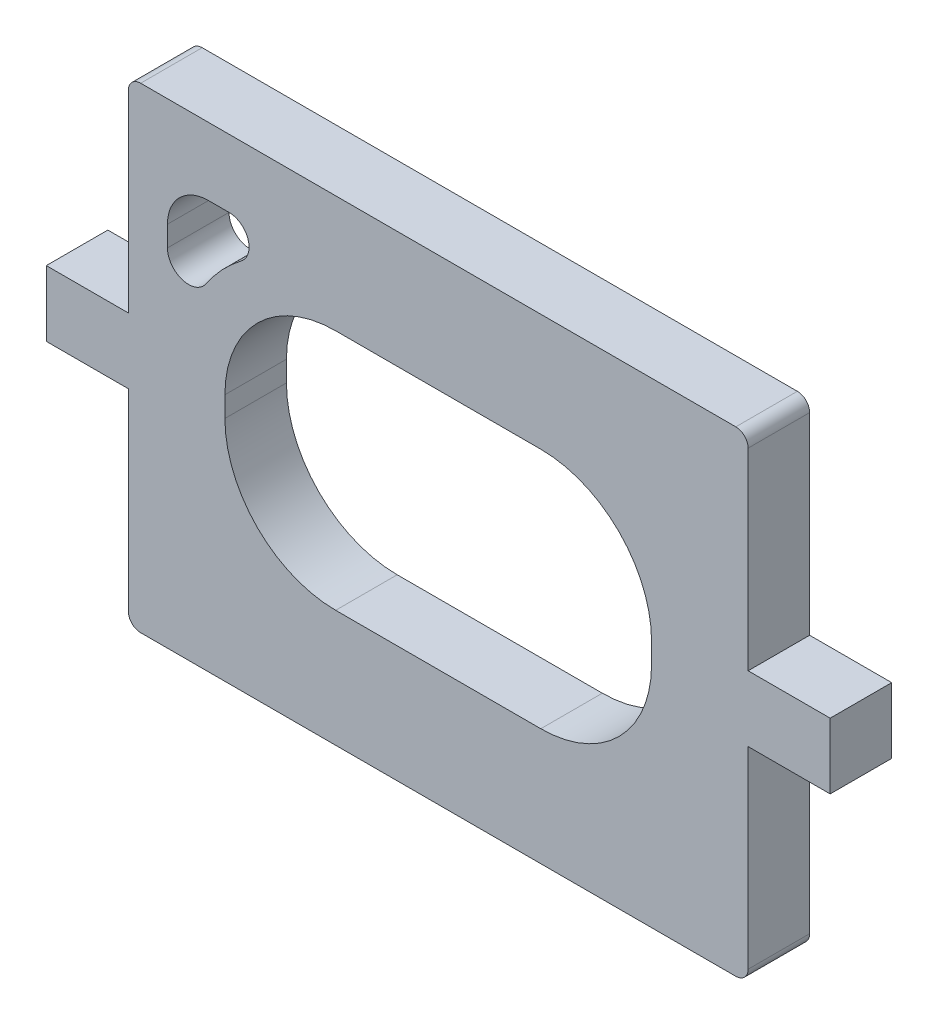
ISO-10303-21;
HEADER;
FILE_DESCRIPTION(('STEP AP214'),'2;1');
FILE_NAME('part.step','',(''),(''),'','','');
FILE_SCHEMA(('AUTOMOTIVE_DESIGN { 1 0 10303 214 1 1 1 1 }'));
ENDSEC;
DATA;
#1=APPLICATION_CONTEXT('core data for automotive mechanical design processes');
#2=APPLICATION_PROTOCOL_DEFINITION('international standard','automotive_design',2000,#1);
#3=PRODUCT_CONTEXT('',#1,'mechanical');
#4=PRODUCT('Part','Part','',(#3));
#5=PRODUCT_RELATED_PRODUCT_CATEGORY('part','',(#4));
#6=PRODUCT_DEFINITION_FORMATION('','',#4);
#7=PRODUCT_DEFINITION_CONTEXT('part definition',#1,'design');
#8=PRODUCT_DEFINITION('design','',#6,#7);
#9=PRODUCT_DEFINITION_SHAPE('','',#8);
#10=(LENGTH_UNIT() NAMED_UNIT(*) SI_UNIT(.MILLI.,.METRE.));
#11=(NAMED_UNIT(*) PLANE_ANGLE_UNIT() SI_UNIT($,.RADIAN.));
#12=(NAMED_UNIT(*) SI_UNIT($,.STERADIAN.) SOLID_ANGLE_UNIT());
#13=UNCERTAINTY_MEASURE_WITH_UNIT(LENGTH_MEASURE(1.E-05),#10,'distance_accuracy_value','');
#14=(GEOMETRIC_REPRESENTATION_CONTEXT(3) GLOBAL_UNCERTAINTY_ASSIGNED_CONTEXT((#13)) GLOBAL_UNIT_ASSIGNED_CONTEXT((#10,
#11,#12)) REPRESENTATION_CONTEXT('',''));
#15=CARTESIAN_POINT('',(0.,0.,0.));
#16=DIRECTION('',(0.,0.,1.));
#17=DIRECTION('',(1.,0.,0.));
#18=AXIS2_PLACEMENT_3D('',#15,#16,#17);
#19=CARTESIAN_POINT('',(34.5642124224768,0.0502130412616117,1.5));
#20=DIRECTION('',(-1.,0.,0.));
#21=DIRECTION('',(0.,0.,1.));
#22=AXIS2_PLACEMENT_3D('',#19,#20,#21);
#23=PLANE('',#22);
#24=DIRECTION('',(0.,0.,-1.));
#25=VECTOR('',#24,1.);
#26=CARTESIAN_POINT('',(34.5642124224768,-6.54978695873839,1.5));
#27=LINE('',#26,#25);
#28=CARTESIAN_POINT('',(34.5642124224768,-6.54978695873839,1.5));
#29=VERTEX_POINT('',#28);
#30=CARTESIAN_POINT('',(34.5642124224768,-6.54978695873839,0.));
#31=VERTEX_POINT('',#30);
#32=EDGE_CURVE('E265',#29,#31,#27,.T.);
#33=ORIENTED_EDGE('',*,*,#32,.F.);
#34=DIRECTION('',(0.,1.,0.));
#35=VECTOR('',#34,1.);
#36=CARTESIAN_POINT('',(34.5642124224768,0.0502130412616117,1.5));
#37=LINE('',#36,#35);
#38=CARTESIAN_POINT('',(34.5642124224768,-11.2497869587384,1.5));
#39=VERTEX_POINT('',#38);
#40=EDGE_CURVE('E412',#39,#29,#37,.T.);
#41=ORIENTED_EDGE('',*,*,#40,.F.);
#42=DIRECTION('',(0.,0.,-1.));
#43=VECTOR('',#42,1.);
#44=CARTESIAN_POINT('',(34.5642124224768,-11.2497869587384,1.5));
#45=LINE('',#44,#43);
#46=CARTESIAN_POINT('',(34.5642124224768,-11.2497869587384,0.));
#47=VERTEX_POINT('',#46);
#48=EDGE_CURVE('E444',#39,#47,#45,.T.);
#49=ORIENTED_EDGE('',*,*,#48,.T.);
#50=DIRECTION('',(0.,1.,0.));
#51=VECTOR('',#50,1.);
#52=CARTESIAN_POINT('',(34.5642124224768,0.0502130412616117,0.));
#53=LINE('',#52,#51);
#54=EDGE_CURVE('E425',#47,#31,#53,.T.);
#55=ORIENTED_EDGE('',*,*,#54,.T.);
#56=EDGE_LOOP('',(#33,#41,#49,#55));
#57=FACE_BOUND('',#56,.T.);
#58=ADVANCED_FACE('F44',(#57),#23,.F.);
#59=DIRECTION('',(0.,0.,1.));
#60=VECTOR('',#59,1.);
#61=CARTESIAN_POINT('',(34.5642124224768,-4.94978695873839,0.));
#62=LINE('',#61,#60);
#63=CARTESIAN_POINT('',(34.5642124224768,-4.94978695873839,0.));
#64=VERTEX_POINT('',#63);
#65=CARTESIAN_POINT('',(34.5642124224768,-4.94978695873839,1.5));
#66=VERTEX_POINT('',#65);
#67=EDGE_CURVE('E261',#64,#66,#62,.T.);
#68=ORIENTED_EDGE('',*,*,#67,.F.);
#69=CARTESIAN_POINT('',(34.5642124224768,-0.249786958738388,0.));
#70=VERTEX_POINT('',#69);
#71=EDGE_CURVE('E424',#64,#70,#53,.T.);
#72=ORIENTED_EDGE('',*,*,#71,.T.);
#73=DIRECTION('',(0.,0.,-1.));
#74=VECTOR('',#73,1.);
#75=CARTESIAN_POINT('',(34.5642124224768,-0.249786958738388,1.5));
#76=LINE('',#75,#74);
#77=CARTESIAN_POINT('',(34.5642124224768,-0.249786958738388,1.5));
#78=VERTEX_POINT('',#77);
#79=EDGE_CURVE('E447',#70,#78,#76,.F.);
#80=ORIENTED_EDGE('',*,*,#79,.T.);
#81=EDGE_CURVE('E411',#66,#78,#37,.T.);
#82=ORIENTED_EDGE('',*,*,#81,.F.);
#83=EDGE_LOOP('',(#68,#72,#80,#82));
#84=FACE_BOUND('',#83,.T.);
#85=ADVANCED_FACE('F515',(#84),#23,.F.);
#86=CARTESIAN_POINT('',(19.4567043731273,-11.5497869587384,1.5));
#87=DIRECTION('',(1.,0.,0.));
#88=DIRECTION('',(0.,0.,-1.));
#89=AXIS2_PLACEMENT_3D('',#86,#87,#88);
#90=PLANE('',#89);
#91=DIRECTION('',(0.,0.,-1.));
#92=VECTOR('',#91,1.);
#93=CARTESIAN_POINT('',(19.4567043731273,-4.94978695873839,1.5));
#94=LINE('',#93,#92);
#95=CARTESIAN_POINT('',(19.4567043731273,-4.94978695873839,1.5));
#96=VERTEX_POINT('',#95);
#97=CARTESIAN_POINT('',(19.4567043731273,-4.94978695873839,0.));
#98=VERTEX_POINT('',#97);
#99=EDGE_CURVE('E267',#96,#98,#94,.T.);
#100=ORIENTED_EDGE('',*,*,#99,.F.);
#101=DIRECTION('',(0.,-1.,0.));
#102=VECTOR('',#101,1.);
#103=CARTESIAN_POINT('',(19.4567043731273,-11.5497869587384,1.5));
#104=LINE('',#103,#102);
#105=CARTESIAN_POINT('',(19.4567043731273,-0.249786958738389,1.5));
#106=VERTEX_POINT('',#105);
#107=EDGE_CURVE('E404',#106,#96,#104,.T.);
#108=ORIENTED_EDGE('',*,*,#107,.F.);
#109=DIRECTION('',(0.,0.,-1.));
#110=VECTOR('',#109,1.);
#111=CARTESIAN_POINT('',(19.4567043731273,-0.249786958738389,1.5));
#112=LINE('',#111,#110);
#113=CARTESIAN_POINT('',(19.4567043731273,-0.249786958738389,0.));
#114=VERTEX_POINT('',#113);
#115=EDGE_CURVE('E461',#106,#114,#112,.T.);
#116=ORIENTED_EDGE('',*,*,#115,.T.);
#117=DIRECTION('',(0.,-1.,0.));
#118=VECTOR('',#117,1.);
#119=CARTESIAN_POINT('',(19.4567043731273,-11.5497869587384,0.));
#120=LINE('',#119,#118);
#121=EDGE_CURVE('E419',#114,#98,#120,.T.);
#122=ORIENTED_EDGE('',*,*,#121,.T.);
#123=EDGE_LOOP('',(#100,#108,#116,#122));
#124=FACE_BOUND('',#123,.T.);
#125=ADVANCED_FACE('F499',(#124),#90,.F.);
#126=DIRECTION('',(0.,0.,1.));
#127=VECTOR('',#126,1.);
#128=CARTESIAN_POINT('',(19.4567043731273,-6.54978695873839,1.5));
#129=LINE('',#128,#127);
#130=CARTESIAN_POINT('',(19.4567043731273,-6.54978695873839,0.));
#131=VERTEX_POINT('',#130);
#132=CARTESIAN_POINT('',(19.4567043731273,-6.54978695873839,1.5));
#133=VERTEX_POINT('',#132);
#134=EDGE_CURVE('E67',#131,#133,#129,.T.);
#135=ORIENTED_EDGE('',*,*,#134,.F.);
#136=CARTESIAN_POINT('',(19.4567043731273,-11.2497869587384,0.));
#137=VERTEX_POINT('',#136);
#138=EDGE_CURVE('E403',#131,#137,#120,.T.);
#139=ORIENTED_EDGE('',*,*,#138,.T.);
#140=DIRECTION('',(0.,0.,-1.));
#141=VECTOR('',#140,1.);
#142=CARTESIAN_POINT('',(19.4567043731273,-11.2497869587384,1.5));
#143=LINE('',#142,#141);
#144=CARTESIAN_POINT('',(19.4567043731273,-11.2497869587384,1.5));
#145=VERTEX_POINT('',#144);
#146=EDGE_CURVE('E458',#137,#145,#143,.F.);
#147=ORIENTED_EDGE('',*,*,#146,.T.);
#148=EDGE_CURVE('E408',#133,#145,#104,.T.);
#149=ORIENTED_EDGE('',*,*,#148,.F.);
#150=EDGE_LOOP('',(#135,#139,#147,#149));
#151=FACE_BOUND('',#150,.T.);
#152=ADVANCED_FACE('F482',(#151),#90,.F.);
#153=CARTESIAN_POINT('',(0.,0.,1.5));
#154=DIRECTION('',(0.,0.,-1.));
#155=DIRECTION('',(-1.,0.,0.));
#156=AXIS2_PLACEMENT_3D('',#153,#154,#155);
#157=PLANE('',#156);
#158=DIRECTION('',(0.,-1.,0.));
#159=VECTOR('',#158,1.);
#160=CARTESIAN_POINT('',(20.4104583978021,-2.59978695873839,1.5));
#161=LINE('',#160,#159);
#162=CARTESIAN_POINT('',(20.4104583978021,-2.59978695873839,1.5));
#163=VERTEX_POINT('',#162);
#164=CARTESIAN_POINT('',(20.4104583978021,-3.09978695873839,1.5));
#165=VERTEX_POINT('',#164);
#166=EDGE_CURVE('E313',#163,#165,#161,.T.);
#167=ORIENTED_EDGE('',*,*,#166,.F.);
#168=CARTESIAN_POINT('',(21.4104583978021,-2.59978695873839,1.5));
#169=DIRECTION('',(0.,0.,1.));
#170=DIRECTION('',(1.,0.,0.));
#171=AXIS2_PLACEMENT_3D('',#168,#169,#170);
#172=CIRCLE('',#171,0.999999999999999);
#173=CARTESIAN_POINT('',(21.4104583978021,-1.59978695873839,1.5));
#174=VERTEX_POINT('',#173);
#175=EDGE_CURVE('E311',#174,#163,#172,.T.);
#176=ORIENTED_EDGE('',*,*,#175,.F.);
#177=DIRECTION('',(-1.,0.,0.));
#178=VECTOR('',#177,1.);
#179=CARTESIAN_POINT('',(21.4104583978021,-1.59978695873839,1.5));
#180=LINE('',#179,#178);
#181=CARTESIAN_POINT('',(21.9104583978021,-1.59978695873839,1.5));
#182=VERTEX_POINT('',#181);
#183=EDGE_CURVE('E325',#182,#174,#180,.T.);
#184=ORIENTED_EDGE('',*,*,#183,.F.);
#185=CARTESIAN_POINT('',(21.9104583978021,-2.08874799769943,1.5));
#186=DIRECTION('',(0.,0.,1.));
#187=DIRECTION('',(-1.,0.,0.));
#188=AXIS2_PLACEMENT_3D('',#185,#186,#187);
#189=CIRCLE('',#188,0.488961038961041);
#190=CARTESIAN_POINT('',(22.2068702070375,-2.47762193224331,1.5));
#191=VERTEX_POINT('',#190);
#192=EDGE_CURVE('E322',#191,#182,#189,.T.);
#193=ORIENTED_EDGE('',*,*,#192,.F.);
#194=CARTESIAN_POINT('',(24.5104583978021,-5.49978695873839,1.5));
#195=DIRECTION('',(0.,0.,-1.));
#196=DIRECTION('',(1.,0.,0.));
#197=AXIS2_PLACEMENT_3D('',#194,#195,#196);
#198=CIRCLE('',#197,3.8);
#199=CARTESIAN_POINT('',(21.3526177054154,-3.38601257117788,1.5));
#200=VERTEX_POINT('',#199);
#201=EDGE_CURVE('E319',#200,#191,#198,.T.);
#202=ORIENTED_EDGE('',*,*,#201,.F.);
#203=CARTESIAN_POINT('',(20.9250153598274,-3.09978695873839,1.5));
#204=DIRECTION('',(0.,0.,1.));
#205=DIRECTION('',(1.,0.,0.));
#206=AXIS2_PLACEMENT_3D('',#203,#204,#205);
#207=CIRCLE('',#206,0.514556962025316);
#208=EDGE_CURVE('E316',#165,#200,#207,.T.);
#209=ORIENTED_EDGE('',*,*,#208,.F.);
#210=EDGE_LOOP('',(#167,#176,#184,#193,#202,#209));
#211=FACE_BOUND('',#210,.T.);
#212=ORIENTED_EDGE('',*,*,#40,.T.);
#213=DIRECTION('',(-1.,0.,0.));
#214=VECTOR('',#213,1.);
#215=CARTESIAN_POINT('',(36.5642124224768,-6.54978695873839,1.5));
#216=LINE('',#215,#214);
#217=CARTESIAN_POINT('',(36.5642124224768,-6.54978695873839,1.5));
#218=VERTEX_POINT('',#217);
#219=EDGE_CURVE('E481',#218,#29,#216,.T.);
#220=ORIENTED_EDGE('',*,*,#219,.F.);
#221=DIRECTION('',(0.,-1.,0.));
#222=VECTOR('',#221,1.);
#223=CARTESIAN_POINT('',(36.5642124224768,-4.94978695873839,1.5));
#224=LINE('',#223,#222);
#225=CARTESIAN_POINT('',(36.5642124224768,-4.94978695873839,1.5));
#226=VERTEX_POINT('',#225);
#227=EDGE_CURVE('E258',#226,#218,#224,.T.);
#228=ORIENTED_EDGE('',*,*,#227,.F.);
#229=DIRECTION('',(-1.,0.,0.));
#230=VECTOR('',#229,1.);
#231=CARTESIAN_POINT('',(36.5642124224768,-4.94978695873839,1.5));
#232=LINE('',#231,#230);
#233=EDGE_CURVE('E59',#226,#66,#232,.T.);
#234=ORIENTED_EDGE('',*,*,#233,.T.);
#235=ORIENTED_EDGE('',*,*,#81,.T.);
#236=CARTESIAN_POINT('',(34.2642124224768,-0.249786958738388,1.5));
#237=DIRECTION('',(0.,0.,-1.));
#238=DIRECTION('',(-1.,0.,0.));
#239=AXIS2_PLACEMENT_3D('',#236,#237,#238);
#240=CIRCLE('',#239,0.3);
#241=CARTESIAN_POINT('',(34.2642124224768,0.0502130412616117,1.5));
#242=VERTEX_POINT('',#241);
#243=EDGE_CURVE('E456',#78,#242,#240,.F.);
#244=ORIENTED_EDGE('',*,*,#243,.T.);
#245=DIRECTION('',(-1.,0.,0.));
#246=VECTOR('',#245,1.);
#247=CARTESIAN_POINT('',(19.4567043731273,0.0502130412616117,1.5));
#248=LINE('',#247,#246);
#249=CARTESIAN_POINT('',(19.7567043731273,0.0502130412616117,1.5));
#250=VERTEX_POINT('',#249);
#251=EDGE_CURVE('E415',#242,#250,#248,.T.);
#252=ORIENTED_EDGE('',*,*,#251,.T.);
#253=CARTESIAN_POINT('',(19.7567043731273,-0.249786958738389,1.5));
#254=DIRECTION('',(0.,0.,-1.));
#255=DIRECTION('',(-1.,0.,0.));
#256=AXIS2_PLACEMENT_3D('',#253,#254,#255);
#257=CIRCLE('',#256,0.3);
#258=EDGE_CURVE('E454',#250,#106,#257,.F.);
#259=ORIENTED_EDGE('',*,*,#258,.T.);
#260=ORIENTED_EDGE('',*,*,#107,.T.);
#261=DIRECTION('',(1.,0.,0.));
#262=VECTOR('',#261,1.);
#263=CARTESIAN_POINT('',(17.4567043731273,-4.94978695873839,1.5));
#264=LINE('',#263,#262);
#265=CARTESIAN_POINT('',(17.4567043731273,-4.94978695873839,1.5));
#266=VERTEX_POINT('',#265);
#267=EDGE_CURVE('E293',#266,#96,#264,.T.);
#268=ORIENTED_EDGE('',*,*,#267,.F.);
#269=DIRECTION('',(0.,1.,0.));
#270=VECTOR('',#269,1.);
#271=CARTESIAN_POINT('',(17.4567043731273,-4.94978695873839,1.5));
#272=LINE('',#271,#270);
#273=CARTESIAN_POINT('',(17.4567043731273,-6.54978695873839,1.5));
#274=VERTEX_POINT('',#273);
#275=EDGE_CURVE('E274',#274,#266,#272,.T.);
#276=ORIENTED_EDGE('',*,*,#275,.F.);
#277=DIRECTION('',(1.,0.,0.));
#278=VECTOR('',#277,1.);
#279=CARTESIAN_POINT('',(17.4567043731273,-6.54978695873839,1.5));
#280=LINE('',#279,#278);
#281=EDGE_CURVE('E282',#274,#133,#280,.T.);
#282=ORIENTED_EDGE('',*,*,#281,.T.);
#283=ORIENTED_EDGE('',*,*,#148,.T.);
#284=CARTESIAN_POINT('',(19.7567043731273,-11.2497869587384,1.5));
#285=DIRECTION('',(0.,0.,-1.));
#286=DIRECTION('',(-1.,0.,0.));
#287=AXIS2_PLACEMENT_3D('',#284,#285,#286);
#288=CIRCLE('',#287,0.3);
#289=CARTESIAN_POINT('',(19.7567043731273,-11.5497869587384,1.5));
#290=VERTEX_POINT('',#289);
#291=EDGE_CURVE('E450',#145,#290,#288,.F.);
#292=ORIENTED_EDGE('',*,*,#291,.T.);
#293=DIRECTION('',(1.,0.,0.));
#294=VECTOR('',#293,1.);
#295=CARTESIAN_POINT('',(19.4567043731273,-11.5497869587384,1.5));
#296=LINE('',#295,#294);
#297=CARTESIAN_POINT('',(34.2642124224768,-11.5497869587384,1.5));
#298=VERTEX_POINT('',#297);
#299=EDGE_CURVE('E407',#290,#298,#296,.T.);
#300=ORIENTED_EDGE('',*,*,#299,.T.);
#301=CARTESIAN_POINT('',(34.2642124224768,-11.2497869587384,1.5));
#302=DIRECTION('',(0.,0.,-1.));
#303=DIRECTION('',(-1.,0.,0.));
#304=AXIS2_PLACEMENT_3D('',#301,#302,#303);
#305=CIRCLE('',#304,0.3);
#306=EDGE_CURVE('E452',#298,#39,#305,.F.);
#307=ORIENTED_EDGE('',*,*,#306,.T.);
#308=EDGE_LOOP('',(#212,#220,#228,#234,#235,#244,#252,#259,#260,#268,#276,#282,#283,#292,#300,#307));
#309=FACE_BOUND('',#308,.T.);
#310=CARTESIAN_POINT('',(24.5104583978021,-5.49978695873839,1.5));
#311=DIRECTION('',(0.,0.,1.));
#312=DIRECTION('',(1.,0.,0.));
#313=AXIS2_PLACEMENT_3D('',#310,#311,#312);
#314=CIRCLE('',#313,2.7);
#315=CARTESIAN_POINT('',(24.5104583978021,-2.79978695873839,1.5));
#316=VERTEX_POINT('',#315);
#317=CARTESIAN_POINT('',(21.8104583978021,-5.49978695873839,1.5));
#318=VERTEX_POINT('',#317);
#319=EDGE_CURVE('E345',#316,#318,#314,.T.);
#320=ORIENTED_EDGE('',*,*,#319,.F.);
#321=DIRECTION('',(-1.,0.,0.));
#322=VECTOR('',#321,1.);
#323=CARTESIAN_POINT('',(29.5104583978021,-2.79978695873839,1.5));
#324=LINE('',#323,#322);
#325=CARTESIAN_POINT('',(29.5104583978021,-2.79978695873839,1.5));
#326=VERTEX_POINT('',#325);
#327=EDGE_CURVE('E361',#326,#316,#324,.T.);
#328=ORIENTED_EDGE('',*,*,#327,.F.);
#329=CARTESIAN_POINT('',(29.5104583978021,-5.49978695873839,1.5));
#330=DIRECTION('',(0.,0.,1.));
#331=DIRECTION('',(1.,0.,0.));
#332=AXIS2_PLACEMENT_3D('',#329,#330,#331);
#333=CIRCLE('',#332,2.7);
#334=CARTESIAN_POINT('',(32.2104583978021,-5.49978695873839,1.5));
#335=VERTEX_POINT('',#334);
#336=EDGE_CURVE('E358',#335,#326,#333,.T.);
#337=ORIENTED_EDGE('',*,*,#336,.F.);
#338=DIRECTION('',(0.,1.,0.));
#339=VECTOR('',#338,1.);
#340=CARTESIAN_POINT('',(32.2104583978021,-5.99978695873839,1.5));
#341=LINE('',#340,#339);
#342=CARTESIAN_POINT('',(32.2104583978021,-5.99978695873839,1.5));
#343=VERTEX_POINT('',#342);
#344=EDGE_CURVE('E356',#343,#335,#341,.T.);
#345=ORIENTED_EDGE('',*,*,#344,.F.);
#346=CARTESIAN_POINT('',(29.5104583978021,-5.99978695873839,1.5));
#347=DIRECTION('',(0.,0.,1.));
#348=DIRECTION('',(1.,0.,0.));
#349=AXIS2_PLACEMENT_3D('',#346,#347,#348);
#350=CIRCLE('',#349,2.7);
#351=CARTESIAN_POINT('',(29.5104583978021,-8.69978695873839,1.5));
#352=VERTEX_POINT('',#351);
#353=EDGE_CURVE('E354',#352,#343,#350,.T.);
#354=ORIENTED_EDGE('',*,*,#353,.F.);
#355=DIRECTION('',(1.,0.,0.));
#356=VECTOR('',#355,1.);
#357=CARTESIAN_POINT('',(24.5104583978021,-8.69978695873839,1.5));
#358=LINE('',#357,#356);
#359=CARTESIAN_POINT('',(24.5104583978021,-8.69978695873839,1.5));
#360=VERTEX_POINT('',#359);
#361=EDGE_CURVE('E352',#360,#352,#358,.T.);
#362=ORIENTED_EDGE('',*,*,#361,.F.);
#363=CARTESIAN_POINT('',(24.5104583978021,-5.99978695873839,1.5));
#364=DIRECTION('',(0.,0.,1.));
#365=DIRECTION('',(1.,0.,0.));
#366=AXIS2_PLACEMENT_3D('',#363,#364,#365);
#367=CIRCLE('',#366,2.7);
#368=CARTESIAN_POINT('',(21.8104583978021,-5.99978695873839,1.5));
#369=VERTEX_POINT('',#368);
#370=EDGE_CURVE('E350',#369,#360,#367,.T.);
#371=ORIENTED_EDGE('',*,*,#370,.F.);
#372=DIRECTION('',(0.,-1.,0.));
#373=VECTOR('',#372,1.);
#374=CARTESIAN_POINT('',(21.8104583978021,-5.49978695873839,1.5));
#375=LINE('',#374,#373);
#376=EDGE_CURVE('E347',#318,#369,#375,.T.);
#377=ORIENTED_EDGE('',*,*,#376,.F.);
#378=EDGE_LOOP('',(#320,#328,#337,#345,#354,#362,#371,#377));
#379=FACE_BOUND('',#378,.T.);
#380=ADVANCED_FACE('F479',(#211,#309,#379),#157,.F.);
#381=CARTESIAN_POINT('',(0.,0.,0.));
#382=DIRECTION('',(0.,0.,-1.));
#383=DIRECTION('',(-1.,0.,0.));
#384=AXIS2_PLACEMENT_3D('',#381,#382,#383);
#385=PLANE('',#384);
#386=CARTESIAN_POINT('',(21.4104583978021,-2.59978695873839,0.));
#387=DIRECTION('',(0.,0.,-1.));
#388=DIRECTION('',(-1.,0.,0.));
#389=AXIS2_PLACEMENT_3D('',#386,#387,#388);
#390=CIRCLE('',#389,0.999999999999999);
#391=CARTESIAN_POINT('',(21.4104583978021,-1.59978695873839,0.));
#392=VERTEX_POINT('',#391);
#393=CARTESIAN_POINT('',(20.4104583978021,-2.59978695873839,0.));
#394=VERTEX_POINT('',#393);
#395=EDGE_CURVE('E308',#392,#394,#390,.F.);
#396=ORIENTED_EDGE('',*,*,#395,.T.);
#397=DIRECTION('',(0.,-1.,0.));
#398=VECTOR('',#397,1.);
#399=CARTESIAN_POINT('',(20.4104583978021,-2.59978695873839,0.));
#400=LINE('',#399,#398);
#401=CARTESIAN_POINT('',(20.4104583978021,-3.09978695873839,0.));
#402=VERTEX_POINT('',#401);
#403=EDGE_CURVE('E331',#394,#402,#400,.T.);
#404=ORIENTED_EDGE('',*,*,#403,.T.);
#405=CARTESIAN_POINT('',(20.9250153598274,-3.09978695873839,0.));
#406=DIRECTION('',(0.,0.,-1.));
#407=DIRECTION('',(-1.,0.,0.));
#408=AXIS2_PLACEMENT_3D('',#405,#406,#407);
#409=CIRCLE('',#408,0.514556962025316);
#410=CARTESIAN_POINT('',(21.3526177054154,-3.38601257117788,0.));
#411=VERTEX_POINT('',#410);
#412=EDGE_CURVE('E296',#402,#411,#409,.F.);
#413=ORIENTED_EDGE('',*,*,#412,.T.);
#414=CARTESIAN_POINT('',(24.5104583978021,-5.49978695873839,0.));
#415=DIRECTION('',(0.,0.,-1.));
#416=DIRECTION('',(-1.,0.,0.));
#417=AXIS2_PLACEMENT_3D('',#414,#415,#416);
#418=CIRCLE('',#417,3.8);
#419=CARTESIAN_POINT('',(22.2068702070375,-2.47762193224331,0.));
#420=VERTEX_POINT('',#419);
#421=EDGE_CURVE('E299',#411,#420,#418,.T.);
#422=ORIENTED_EDGE('',*,*,#421,.T.);
#423=CARTESIAN_POINT('',(21.9104583978021,-2.08874799769943,0.));
#424=DIRECTION('',(0.,0.,-1.));
#425=DIRECTION('',(-1.,0.,0.));
#426=AXIS2_PLACEMENT_3D('',#423,#424,#425);
#427=CIRCLE('',#426,0.488961038961041);
#428=CARTESIAN_POINT('',(21.9104583978021,-1.59978695873839,0.));
#429=VERTEX_POINT('',#428);
#430=EDGE_CURVE('E302',#420,#429,#427,.F.);
#431=ORIENTED_EDGE('',*,*,#430,.T.);
#432=DIRECTION('',(-1.,0.,0.));
#433=VECTOR('',#432,1.);
#434=CARTESIAN_POINT('',(21.4104583978021,-1.59978695873839,0.));
#435=LINE('',#434,#433);
#436=EDGE_CURVE('E305',#429,#392,#435,.T.);
#437=ORIENTED_EDGE('',*,*,#436,.T.);
#438=EDGE_LOOP('',(#396,#404,#413,#422,#431,#437));
#439=FACE_BOUND('',#438,.T.);
#440=DIRECTION('',(-1.,0.,0.));
#441=VECTOR('',#440,1.);
#442=CARTESIAN_POINT('',(19.4567043731273,0.0502130412616117,0.));
#443=LINE('',#442,#441);
#444=CARTESIAN_POINT('',(34.2642124224768,0.0502130412616117,0.));
#445=VERTEX_POINT('',#444);
#446=CARTESIAN_POINT('',(19.7567043731273,0.0502130412616117,0.));
#447=VERTEX_POINT('',#446);
#448=EDGE_CURVE('E427',#445,#447,#443,.T.);
#449=ORIENTED_EDGE('',*,*,#448,.F.);
#450=CARTESIAN_POINT('',(34.2642124224768,-0.249786958738388,0.));
#451=DIRECTION('',(0.,0.,-1.));
#452=DIRECTION('',(-1.,0.,0.));
#453=AXIS2_PLACEMENT_3D('',#450,#451,#452);
#454=CIRCLE('',#453,0.3);
#455=EDGE_CURVE('E441',#445,#70,#454,.T.);
#456=ORIENTED_EDGE('',*,*,#455,.T.);
#457=ORIENTED_EDGE('',*,*,#71,.F.);
#458=DIRECTION('',(-1.,0.,0.));
#459=VECTOR('',#458,1.);
#460=CARTESIAN_POINT('',(36.5642124224768,-4.94978695873839,0.));
#461=LINE('',#460,#459);
#462=CARTESIAN_POINT('',(36.5642124224768,-4.94978695873839,0.));
#463=VERTEX_POINT('',#462);
#464=EDGE_CURVE('E250',#463,#64,#461,.T.);
#465=ORIENTED_EDGE('',*,*,#464,.F.);
#466=DIRECTION('',(0.,1.,0.));
#467=VECTOR('',#466,1.);
#468=CARTESIAN_POINT('',(36.5642124224768,-6.54978695873839,0.));
#469=LINE('',#468,#467);
#470=CARTESIAN_POINT('',(36.5642124224768,-6.54978695873839,0.));
#471=VERTEX_POINT('',#470);
#472=EDGE_CURVE('E240',#471,#463,#469,.T.);
#473=ORIENTED_EDGE('',*,*,#472,.F.);
#474=DIRECTION('',(-1.,0.,0.));
#475=VECTOR('',#474,1.);
#476=CARTESIAN_POINT('',(36.5642124224768,-6.54978695873839,0.));
#477=LINE('',#476,#475);
#478=EDGE_CURVE('E247',#471,#31,#477,.T.);
#479=ORIENTED_EDGE('',*,*,#478,.T.);
#480=ORIENTED_EDGE('',*,*,#54,.F.);
#481=CARTESIAN_POINT('',(34.2642124224768,-11.2497869587384,0.));
#482=DIRECTION('',(0.,0.,-1.));
#483=DIRECTION('',(-1.,0.,0.));
#484=AXIS2_PLACEMENT_3D('',#481,#482,#483);
#485=CIRCLE('',#484,0.3);
#486=CARTESIAN_POINT('',(34.2642124224768,-11.5497869587384,0.));
#487=VERTEX_POINT('',#486);
#488=EDGE_CURVE('E437',#47,#487,#485,.T.);
#489=ORIENTED_EDGE('',*,*,#488,.T.);
#490=DIRECTION('',(1.,0.,0.));
#491=VECTOR('',#490,1.);
#492=CARTESIAN_POINT('',(19.4567043731273,-11.5497869587384,0.));
#493=LINE('',#492,#491);
#494=CARTESIAN_POINT('',(19.7567043731273,-11.5497869587384,0.));
#495=VERTEX_POINT('',#494);
#496=EDGE_CURVE('E421',#495,#487,#493,.T.);
#497=ORIENTED_EDGE('',*,*,#496,.F.);
#498=CARTESIAN_POINT('',(19.7567043731273,-11.2497869587384,0.));
#499=DIRECTION('',(0.,0.,-1.));
#500=DIRECTION('',(-1.,0.,0.));
#501=AXIS2_PLACEMENT_3D('',#498,#499,#500);
#502=CIRCLE('',#501,0.3);
#503=EDGE_CURVE('E434',#495,#137,#502,.T.);
#504=ORIENTED_EDGE('',*,*,#503,.T.);
#505=ORIENTED_EDGE('',*,*,#138,.F.);
#506=DIRECTION('',(1.,0.,0.));
#507=VECTOR('',#506,1.);
#508=CARTESIAN_POINT('',(17.4567043731273,-6.54978695873839,0.));
#509=LINE('',#508,#507);
#510=CARTESIAN_POINT('',(17.4567043731273,-6.54978695873839,0.));
#511=VERTEX_POINT('',#510);
#512=EDGE_CURVE('E287',#511,#131,#509,.T.);
#513=ORIENTED_EDGE('',*,*,#512,.F.);
#514=DIRECTION('',(0.,-1.,0.));
#515=VECTOR('',#514,1.);
#516=CARTESIAN_POINT('',(17.4567043731273,-6.54978695873839,0.));
#517=LINE('',#516,#515);
#518=CARTESIAN_POINT('',(17.4567043731273,-4.94978695873839,0.));
#519=VERTEX_POINT('',#518);
#520=EDGE_CURVE('E279',#519,#511,#517,.T.);
#521=ORIENTED_EDGE('',*,*,#520,.F.);
#522=DIRECTION('',(1.,0.,0.));
#523=VECTOR('',#522,1.);
#524=CARTESIAN_POINT('',(17.4567043731273,-4.94978695873839,0.));
#525=LINE('',#524,#523);
#526=EDGE_CURVE('E290',#519,#98,#525,.T.);
#527=ORIENTED_EDGE('',*,*,#526,.T.);
#528=ORIENTED_EDGE('',*,*,#121,.F.);
#529=CARTESIAN_POINT('',(19.7567043731273,-0.249786958738389,0.));
#530=DIRECTION('',(0.,0.,-1.));
#531=DIRECTION('',(-1.,0.,0.));
#532=AXIS2_PLACEMENT_3D('',#529,#530,#531);
#533=CIRCLE('',#532,0.3);
#534=EDGE_CURVE('E439',#114,#447,#533,.T.);
#535=ORIENTED_EDGE('',*,*,#534,.T.);
#536=EDGE_LOOP('',(#449,#456,#457,#465,#473,#479,#480,#489,#497,#504,#505,#513,#521,#527,#528,#535));
#537=FACE_BOUND('',#536,.T.);
#538=DIRECTION('',(-1.,0.,0.));
#539=VECTOR('',#538,1.);
#540=CARTESIAN_POINT('',(29.5104583978021,-2.79978695873839,0.));
#541=LINE('',#540,#539);
#542=CARTESIAN_POINT('',(29.5104583978021,-2.79978695873839,0.));
#543=VERTEX_POINT('',#542);
#544=CARTESIAN_POINT('',(24.5104583978021,-2.79978695873839,0.));
#545=VERTEX_POINT('',#544);
#546=EDGE_CURVE('E348',#543,#545,#541,.T.);
#547=ORIENTED_EDGE('',*,*,#546,.T.);
#548=CARTESIAN_POINT('',(24.5104583978021,-5.49978695873839,0.));
#549=DIRECTION('',(0.,0.,1.));
#550=DIRECTION('',(1.,0.,0.));
#551=AXIS2_PLACEMENT_3D('',#548,#549,#550);
#552=CIRCLE('',#551,2.7);
#553=CARTESIAN_POINT('',(21.8104583978021,-5.49978695873839,0.));
#554=VERTEX_POINT('',#553);
#555=EDGE_CURVE('E344',#545,#554,#552,.T.);
#556=ORIENTED_EDGE('',*,*,#555,.T.);
#557=DIRECTION('',(0.,-1.,0.));
#558=VECTOR('',#557,1.);
#559=CARTESIAN_POINT('',(21.8104583978021,-5.49978695873839,0.));
#560=LINE('',#559,#558);
#561=CARTESIAN_POINT('',(21.8104583978021,-5.99978695873839,0.));
#562=VERTEX_POINT('',#561);
#563=EDGE_CURVE('E366',#554,#562,#560,.T.);
#564=ORIENTED_EDGE('',*,*,#563,.T.);
#565=CARTESIAN_POINT('',(24.5104583978021,-5.99978695873839,0.));
#566=DIRECTION('',(0.,0.,1.));
#567=DIRECTION('',(1.,0.,0.));
#568=AXIS2_PLACEMENT_3D('',#565,#566,#567);
#569=CIRCLE('',#568,2.7);
#570=CARTESIAN_POINT('',(24.5104583978021,-8.69978695873839,0.));
#571=VERTEX_POINT('',#570);
#572=EDGE_CURVE('E369',#562,#571,#569,.T.);
#573=ORIENTED_EDGE('',*,*,#572,.T.);
#574=DIRECTION('',(1.,0.,0.));
#575=VECTOR('',#574,1.);
#576=CARTESIAN_POINT('',(24.5104583978021,-8.69978695873839,0.));
#577=LINE('',#576,#575);
#578=CARTESIAN_POINT('',(29.5104583978021,-8.69978695873839,0.));
#579=VERTEX_POINT('',#578);
#580=EDGE_CURVE('E372',#571,#579,#577,.T.);
#581=ORIENTED_EDGE('',*,*,#580,.T.);
#582=CARTESIAN_POINT('',(29.5104583978021,-5.99978695873839,0.));
#583=DIRECTION('',(0.,0.,1.));
#584=DIRECTION('',(1.,0.,0.));
#585=AXIS2_PLACEMENT_3D('',#582,#583,#584);
#586=CIRCLE('',#585,2.7);
#587=CARTESIAN_POINT('',(32.2104583978021,-5.99978695873839,0.));
#588=VERTEX_POINT('',#587);
#589=EDGE_CURVE('E375',#579,#588,#586,.T.);
#590=ORIENTED_EDGE('',*,*,#589,.T.);
#591=DIRECTION('',(0.,1.,0.));
#592=VECTOR('',#591,1.);
#593=CARTESIAN_POINT('',(32.2104583978021,-5.99978695873839,0.));
#594=LINE('',#593,#592);
#595=CARTESIAN_POINT('',(32.2104583978021,-5.49978695873839,0.));
#596=VERTEX_POINT('',#595);
#597=EDGE_CURVE('E378',#588,#596,#594,.T.);
#598=ORIENTED_EDGE('',*,*,#597,.T.);
#599=CARTESIAN_POINT('',(29.5104583978021,-5.49978695873839,0.));
#600=DIRECTION('',(0.,0.,1.));
#601=DIRECTION('',(1.,0.,0.));
#602=AXIS2_PLACEMENT_3D('',#599,#600,#601);
#603=CIRCLE('',#602,2.7);
#604=EDGE_CURVE('E381',#596,#543,#603,.T.);
#605=ORIENTED_EDGE('',*,*,#604,.T.);
#606=EDGE_LOOP('',(#547,#556,#564,#573,#581,#590,#598,#605));
#607=FACE_BOUND('',#606,.T.);
#608=ADVANCED_FACE('F243',(#439,#537,#607),#385,.T.);
#609=CARTESIAN_POINT('',(19.4567043731273,-11.5497869587384,1.5));
#610=DIRECTION('',(0.,1.,0.));
#611=DIRECTION('',(0.,0.,1.));
#612=AXIS2_PLACEMENT_3D('',#609,#610,#611);
#613=PLANE('',#612);
#614=ORIENTED_EDGE('',*,*,#496,.T.);
#615=DIRECTION('',(0.,0.,-1.));
#616=VECTOR('',#615,1.);
#617=CARTESIAN_POINT('',(34.2642124224768,-11.5497869587384,1.5));
#618=LINE('',#617,#616);
#619=EDGE_CURVE('E13',#487,#298,#618,.F.);
#620=ORIENTED_EDGE('',*,*,#619,.T.);
#621=ORIENTED_EDGE('',*,*,#299,.F.);
#622=DIRECTION('',(0.,0.,-1.));
#623=VECTOR('',#622,1.);
#624=CARTESIAN_POINT('',(19.7567043731273,-11.5497869587384,1.5));
#625=LINE('',#624,#623);
#626=EDGE_CURVE('E52',#290,#495,#625,.T.);
#627=ORIENTED_EDGE('',*,*,#626,.T.);
#628=EDGE_LOOP('',(#614,#620,#621,#627));
#629=FACE_BOUND('',#628,.T.);
#630=ADVANCED_FACE('F468',(#629),#613,.F.);
#631=CARTESIAN_POINT('',(19.4567043731273,0.0502130412616117,1.5));
#632=DIRECTION('',(0.,-1.,0.));
#633=DIRECTION('',(0.,0.,-1.));
#634=AXIS2_PLACEMENT_3D('',#631,#632,#633);
#635=PLANE('',#634);
#636=ORIENTED_EDGE('',*,*,#251,.F.);
#637=DIRECTION('',(0.,0.,-1.));
#638=VECTOR('',#637,1.);
#639=CARTESIAN_POINT('',(34.2642124224768,0.0502130412616117,1.5));
#640=LINE('',#639,#638);
#641=EDGE_CURVE('E431',#242,#445,#640,.T.);
#642=ORIENTED_EDGE('',*,*,#641,.T.);
#643=ORIENTED_EDGE('',*,*,#448,.T.);
#644=DIRECTION('',(0.,0.,-1.));
#645=VECTOR('',#644,1.);
#646=CARTESIAN_POINT('',(19.7567043731273,0.0502130412616117,1.5));
#647=LINE('',#646,#645);
#648=EDGE_CURVE('E418',#447,#250,#647,.F.);
#649=ORIENTED_EDGE('',*,*,#648,.T.);
#650=EDGE_LOOP('',(#636,#642,#643,#649));
#651=FACE_BOUND('',#650,.T.);
#652=ADVANCED_FACE('F507',(#651),#635,.F.);
#653=CARTESIAN_POINT('',(24.5104583978021,-5.49978695873839,1.5));
#654=DIRECTION('',(0.,0.,-1.));
#655=DIRECTION('',(-1.,0.,0.));
#656=AXIS2_PLACEMENT_3D('',#653,#654,#655);
#657=CYLINDRICAL_SURFACE('',#656,2.7);
#658=ORIENTED_EDGE('',*,*,#555,.F.);
#659=DIRECTION('',(0.,0.,-1.));
#660=VECTOR('',#659,1.);
#661=CARTESIAN_POINT('',(24.5104583978021,-2.79978695873839,1.5));
#662=LINE('',#661,#660);
#663=EDGE_CURVE('E363',#316,#545,#662,.T.);
#664=ORIENTED_EDGE('',*,*,#663,.F.);
#665=ORIENTED_EDGE('',*,*,#319,.T.);
#666=DIRECTION('',(0.,0.,-1.));
#667=VECTOR('',#666,1.);
#668=CARTESIAN_POINT('',(21.8104583978021,-5.49978695873839,1.5));
#669=LINE('',#668,#667);
#670=EDGE_CURVE('E400',#318,#554,#669,.T.);
#671=ORIENTED_EDGE('',*,*,#670,.T.);
#672=EDGE_LOOP('',(#658,#664,#665,#671));
#673=FACE_BOUND('',#672,.T.);
#674=ADVANCED_FACE('F595',(#673),#657,.F.);
#675=CARTESIAN_POINT('',(21.8104583978021,-5.49978695873839,1.5));
#676=DIRECTION('',(1.,0.,0.));
#677=DIRECTION('',(0.,1.,0.));
#678=AXIS2_PLACEMENT_3D('',#675,#676,#677);
#679=PLANE('',#678);
#680=ORIENTED_EDGE('',*,*,#563,.F.);
#681=ORIENTED_EDGE('',*,*,#670,.F.);
#682=ORIENTED_EDGE('',*,*,#376,.T.);
#683=DIRECTION('',(0.,0.,-1.));
#684=VECTOR('',#683,1.);
#685=CARTESIAN_POINT('',(21.8104583978021,-5.99978695873839,1.5));
#686=LINE('',#685,#684);
#687=EDGE_CURVE('E398',#369,#562,#686,.T.);
#688=ORIENTED_EDGE('',*,*,#687,.T.);
#689=EDGE_LOOP('',(#680,#681,#682,#688));
#690=FACE_BOUND('',#689,.T.);
#691=ADVANCED_FACE('F591',(#690),#679,.T.);
#692=CARTESIAN_POINT('',(24.5104583978021,-5.99978695873839,1.5));
#693=DIRECTION('',(0.,0.,-1.));
#694=DIRECTION('',(-1.,0.,0.));
#695=AXIS2_PLACEMENT_3D('',#692,#693,#694);
#696=CYLINDRICAL_SURFACE('',#695,2.7);
#697=ORIENTED_EDGE('',*,*,#572,.F.);
#698=ORIENTED_EDGE('',*,*,#687,.F.);
#699=ORIENTED_EDGE('',*,*,#370,.T.);
#700=DIRECTION('',(0.,0.,-1.));
#701=VECTOR('',#700,1.);
#702=CARTESIAN_POINT('',(24.5104583978021,-8.69978695873839,1.5));
#703=LINE('',#702,#701);
#704=EDGE_CURVE('E396',#360,#571,#703,.T.);
#705=ORIENTED_EDGE('',*,*,#704,.T.);
#706=EDGE_LOOP('',(#697,#698,#699,#705));
#707=FACE_BOUND('',#706,.T.);
#708=ADVANCED_FACE('F587',(#707),#696,.F.);
#709=CARTESIAN_POINT('',(24.5104583978021,-8.69978695873839,1.5));
#710=DIRECTION('',(0.,1.,0.));
#711=DIRECTION('',(0.,0.,1.));
#712=AXIS2_PLACEMENT_3D('',#709,#710,#711);
#713=PLANE('',#712);
#714=ORIENTED_EDGE('',*,*,#580,.F.);
#715=ORIENTED_EDGE('',*,*,#704,.F.);
#716=ORIENTED_EDGE('',*,*,#361,.T.);
#717=DIRECTION('',(0.,0.,-1.));
#718=VECTOR('',#717,1.);
#719=CARTESIAN_POINT('',(29.5104583978021,-8.69978695873839,1.5));
#720=LINE('',#719,#718);
#721=EDGE_CURVE('E394',#352,#579,#720,.T.);
#722=ORIENTED_EDGE('',*,*,#721,.T.);
#723=EDGE_LOOP('',(#714,#715,#716,#722));
#724=FACE_BOUND('',#723,.T.);
#725=ADVANCED_FACE('F583',(#724),#713,.T.);
#726=CARTESIAN_POINT('',(29.5104583978021,-5.99978695873839,1.5));
#727=DIRECTION('',(0.,0.,-1.));
#728=DIRECTION('',(-1.,0.,0.));
#729=AXIS2_PLACEMENT_3D('',#726,#727,#728);
#730=CYLINDRICAL_SURFACE('',#729,2.7);
#731=ORIENTED_EDGE('',*,*,#589,.F.);
#732=ORIENTED_EDGE('',*,*,#721,.F.);
#733=ORIENTED_EDGE('',*,*,#353,.T.);
#734=DIRECTION('',(0.,0.,-1.));
#735=VECTOR('',#734,1.);
#736=CARTESIAN_POINT('',(32.2104583978021,-5.99978695873839,1.5));
#737=LINE('',#736,#735);
#738=EDGE_CURVE('E392',#343,#588,#737,.T.);
#739=ORIENTED_EDGE('',*,*,#738,.T.);
#740=EDGE_LOOP('',(#731,#732,#733,#739));
#741=FACE_BOUND('',#740,.T.);
#742=ADVANCED_FACE('F579',(#741),#730,.F.);
#743=CARTESIAN_POINT('',(32.2104583978021,-5.99978695873839,1.5));
#744=DIRECTION('',(-1.,0.,0.));
#745=DIRECTION('',(0.,0.,1.));
#746=AXIS2_PLACEMENT_3D('',#743,#744,#745);
#747=PLANE('',#746);
#748=ORIENTED_EDGE('',*,*,#597,.F.);
#749=ORIENTED_EDGE('',*,*,#738,.F.);
#750=ORIENTED_EDGE('',*,*,#344,.T.);
#751=DIRECTION('',(0.,0.,-1.));
#752=VECTOR('',#751,1.);
#753=CARTESIAN_POINT('',(32.2104583978021,-5.49978695873839,1.5));
#754=LINE('',#753,#752);
#755=EDGE_CURVE('E390',#335,#596,#754,.T.);
#756=ORIENTED_EDGE('',*,*,#755,.T.);
#757=EDGE_LOOP('',(#748,#749,#750,#756));
#758=FACE_BOUND('',#757,.T.);
#759=ADVANCED_FACE('F575',(#758),#747,.T.);
#760=CARTESIAN_POINT('',(29.5104583978021,-5.49978695873839,1.5));
#761=DIRECTION('',(0.,0.,-1.));
#762=DIRECTION('',(-1.,0.,0.));
#763=AXIS2_PLACEMENT_3D('',#760,#761,#762);
#764=CYLINDRICAL_SURFACE('',#763,2.7);
#765=ORIENTED_EDGE('',*,*,#604,.F.);
#766=ORIENTED_EDGE('',*,*,#755,.F.);
#767=ORIENTED_EDGE('',*,*,#336,.T.);
#768=DIRECTION('',(0.,0.,-1.));
#769=VECTOR('',#768,1.);
#770=CARTESIAN_POINT('',(29.5104583978021,-2.79978695873839,1.5));
#771=LINE('',#770,#769);
#772=EDGE_CURVE('E388',#326,#543,#771,.T.);
#773=ORIENTED_EDGE('',*,*,#772,.T.);
#774=EDGE_LOOP('',(#765,#766,#767,#773));
#775=FACE_BOUND('',#774,.T.);
#776=ADVANCED_FACE('F571',(#775),#764,.F.);
#777=CARTESIAN_POINT('',(29.5104583978021,-2.79978695873839,1.5));
#778=DIRECTION('',(0.,-1.,0.));
#779=DIRECTION('',(1.,0.,0.));
#780=AXIS2_PLACEMENT_3D('',#777,#778,#779);
#781=PLANE('',#780);
#782=ORIENTED_EDGE('',*,*,#546,.F.);
#783=ORIENTED_EDGE('',*,*,#772,.F.);
#784=ORIENTED_EDGE('',*,*,#327,.T.);
#785=ORIENTED_EDGE('',*,*,#663,.T.);
#786=EDGE_LOOP('',(#782,#783,#784,#785));
#787=FACE_BOUND('',#786,.T.);
#788=ADVANCED_FACE('F546',(#787),#781,.T.);
#789=CARTESIAN_POINT('',(34.2642124224768,-0.249786958738388,1.5));
#790=DIRECTION('',(0.,0.,-1.));
#791=DIRECTION('',(-1.,0.,0.));
#792=AXIS2_PLACEMENT_3D('',#789,#790,#791);
#793=CYLINDRICAL_SURFACE('',#792,0.3);
#794=ORIENTED_EDGE('',*,*,#243,.F.);
#795=ORIENTED_EDGE('',*,*,#79,.F.);
#796=ORIENTED_EDGE('',*,*,#455,.F.);
#797=ORIENTED_EDGE('',*,*,#641,.F.);
#798=EDGE_LOOP('',(#794,#795,#796,#797));
#799=FACE_BOUND('',#798,.T.);
#800=ADVANCED_FACE('F511',(#799),#793,.T.);
#801=CARTESIAN_POINT('',(19.7567043731273,-0.249786958738389,1.5));
#802=DIRECTION('',(0.,0.,-1.));
#803=DIRECTION('',(-1.,0.,0.));
#804=AXIS2_PLACEMENT_3D('',#801,#802,#803);
#805=CYLINDRICAL_SURFACE('',#804,0.3);
#806=ORIENTED_EDGE('',*,*,#258,.F.);
#807=ORIENTED_EDGE('',*,*,#648,.F.);
#808=ORIENTED_EDGE('',*,*,#534,.F.);
#809=ORIENTED_EDGE('',*,*,#115,.F.);
#810=EDGE_LOOP('',(#806,#807,#808,#809));
#811=FACE_BOUND('',#810,.T.);
#812=ADVANCED_FACE('F505',(#811),#805,.T.);
#813=CARTESIAN_POINT('',(34.2642124224768,-11.2497869587384,1.5));
#814=DIRECTION('',(0.,0.,-1.));
#815=DIRECTION('',(-1.,0.,0.));
#816=AXIS2_PLACEMENT_3D('',#813,#814,#815);
#817=CYLINDRICAL_SURFACE('',#816,0.3);
#818=ORIENTED_EDGE('',*,*,#306,.F.);
#819=ORIENTED_EDGE('',*,*,#619,.F.);
#820=ORIENTED_EDGE('',*,*,#488,.F.);
#821=ORIENTED_EDGE('',*,*,#48,.F.);
#822=EDGE_LOOP('',(#818,#819,#820,#821));
#823=FACE_BOUND('',#822,.T.);
#824=ADVANCED_FACE('F476',(#823),#817,.T.);
#825=CARTESIAN_POINT('',(19.7567043731273,-11.2497869587384,1.5));
#826=DIRECTION('',(0.,0.,-1.));
#827=DIRECTION('',(-1.,0.,0.));
#828=AXIS2_PLACEMENT_3D('',#825,#826,#827);
#829=CYLINDRICAL_SURFACE('',#828,0.3);
#830=ORIENTED_EDGE('',*,*,#291,.F.);
#831=ORIENTED_EDGE('',*,*,#146,.F.);
#832=ORIENTED_EDGE('',*,*,#503,.F.);
#833=ORIENTED_EDGE('',*,*,#626,.F.);
#834=EDGE_LOOP('',(#830,#831,#832,#833));
#835=FACE_BOUND('',#834,.T.);
#836=ADVANCED_FACE('F46',(#835),#829,.T.);
#837=CARTESIAN_POINT('',(21.4104583978021,-2.59978695873839,-0.000999999999999916));
#838=DIRECTION('',(0.,0.,1.));
#839=DIRECTION('',(1.,0.,0.));
#840=AXIS2_PLACEMENT_3D('',#837,#838,#839);
#841=CYLINDRICAL_SURFACE('',#840,0.999999999999999);
#842=DIRECTION('',(0.,0.,1.));
#843=VECTOR('',#842,1.);
#844=CARTESIAN_POINT('',(21.4104583978021,-1.59978695873839,-0.000999999999999916));
#845=LINE('',#844,#843);
#846=EDGE_CURVE('E329',#392,#174,#845,.T.);
#847=ORIENTED_EDGE('',*,*,#846,.T.);
#848=ORIENTED_EDGE('',*,*,#175,.T.);
#849=DIRECTION('',(0.,0.,1.));
#850=VECTOR('',#849,1.);
#851=CARTESIAN_POINT('',(20.4104583978021,-2.59978695873839,-0.000999999999999916));
#852=LINE('',#851,#850);
#853=EDGE_CURVE('E328',#394,#163,#852,.T.);
#854=ORIENTED_EDGE('',*,*,#853,.F.);
#855=ORIENTED_EDGE('',*,*,#395,.F.);
#856=EDGE_LOOP('',(#847,#848,#854,#855));
#857=FACE_BOUND('',#856,.T.);
#858=ADVANCED_FACE('F552',(#857),#841,.F.);
#859=CARTESIAN_POINT('',(21.4104583978021,-1.59978695873839,-0.000999999999999916));
#860=DIRECTION('',(0.,1.,0.));
#861=DIRECTION('',(-1.,0.,0.));
#862=AXIS2_PLACEMENT_3D('',#859,#860,#861);
#863=PLANE('',#862);
#864=DIRECTION('',(0.,0.,1.));
#865=VECTOR('',#864,1.);
#866=CARTESIAN_POINT('',(21.9104583978021,-1.59978695873839,-0.000999999999999916));
#867=LINE('',#866,#865);
#868=EDGE_CURVE('E332',#429,#182,#867,.T.);
#869=ORIENTED_EDGE('',*,*,#868,.T.);
#870=ORIENTED_EDGE('',*,*,#183,.T.);
#871=ORIENTED_EDGE('',*,*,#846,.F.);
#872=ORIENTED_EDGE('',*,*,#436,.F.);
#873=EDGE_LOOP('',(#869,#870,#871,#872));
#874=FACE_BOUND('',#873,.T.);
#875=ADVANCED_FACE('F556',(#874),#863,.F.);
#876=CARTESIAN_POINT('',(21.9104583978021,-2.08874799769943,-0.000999999999999916));
#877=DIRECTION('',(0.,0.,1.));
#878=DIRECTION('',(1.,0.,0.));
#879=AXIS2_PLACEMENT_3D('',#876,#877,#878);
#880=CYLINDRICAL_SURFACE('',#879,0.488961038961041);
#881=DIRECTION('',(0.,0.,1.));
#882=VECTOR('',#881,1.);
#883=CARTESIAN_POINT('',(22.2068702070375,-2.47762193224331,-0.000999999999999916));
#884=LINE('',#883,#882);
#885=EDGE_CURVE('E334',#420,#191,#884,.T.);
#886=ORIENTED_EDGE('',*,*,#885,.T.);
#887=ORIENTED_EDGE('',*,*,#192,.T.);
#888=ORIENTED_EDGE('',*,*,#868,.F.);
#889=ORIENTED_EDGE('',*,*,#430,.F.);
#890=EDGE_LOOP('',(#886,#887,#888,#889));
#891=FACE_BOUND('',#890,.T.);
#892=ADVANCED_FACE('F562',(#891),#880,.F.);
#893=CARTESIAN_POINT('',(24.5104583978021,-5.49978695873839,-0.000999999999999916));
#894=DIRECTION('',(0.,0.,1.));
#895=DIRECTION('',(1.,0.,0.));
#896=AXIS2_PLACEMENT_3D('',#893,#894,#895);
#897=CYLINDRICAL_SURFACE('',#896,3.8);
#898=DIRECTION('',(0.,0.,1.));
#899=VECTOR('',#898,1.);
#900=CARTESIAN_POINT('',(21.3526177054154,-3.38601257117788,-0.000999999999999916));
#901=LINE('',#900,#899);
#902=EDGE_CURVE('E336',#411,#200,#901,.T.);
#903=ORIENTED_EDGE('',*,*,#902,.T.);
#904=ORIENTED_EDGE('',*,*,#201,.T.);
#905=ORIENTED_EDGE('',*,*,#885,.F.);
#906=ORIENTED_EDGE('',*,*,#421,.F.);
#907=EDGE_LOOP('',(#903,#904,#905,#906));
#908=FACE_BOUND('',#907,.T.);
#909=ADVANCED_FACE('F621',(#908),#897,.T.);
#910=CARTESIAN_POINT('',(20.9250153598274,-3.09978695873839,-0.000999999999999916));
#911=DIRECTION('',(0.,0.,1.));
#912=DIRECTION('',(1.,0.,0.));
#913=AXIS2_PLACEMENT_3D('',#910,#911,#912);
#914=CYLINDRICAL_SURFACE('',#913,0.514556962025316);
#915=DIRECTION('',(0.,0.,1.));
#916=VECTOR('',#915,1.);
#917=CARTESIAN_POINT('',(20.4104583978021,-3.09978695873839,-0.000999999999999916));
#918=LINE('',#917,#916);
#919=EDGE_CURVE('E338',#402,#165,#918,.T.);
#920=ORIENTED_EDGE('',*,*,#919,.T.);
#921=ORIENTED_EDGE('',*,*,#208,.T.);
#922=ORIENTED_EDGE('',*,*,#902,.F.);
#923=ORIENTED_EDGE('',*,*,#412,.F.);
#924=EDGE_LOOP('',(#920,#921,#922,#923));
#925=FACE_BOUND('',#924,.T.);
#926=ADVANCED_FACE('F618',(#925),#914,.F.);
#927=CARTESIAN_POINT('',(20.4104583978021,-2.59978695873839,-0.000999999999999916));
#928=DIRECTION('',(-1.,0.,0.));
#929=DIRECTION('',(0.,0.,1.));
#930=AXIS2_PLACEMENT_3D('',#927,#928,#929);
#931=PLANE('',#930);
#932=ORIENTED_EDGE('',*,*,#853,.T.);
#933=ORIENTED_EDGE('',*,*,#166,.T.);
#934=ORIENTED_EDGE('',*,*,#919,.F.);
#935=ORIENTED_EDGE('',*,*,#403,.F.);
#936=EDGE_LOOP('',(#932,#933,#934,#935));
#937=FACE_BOUND('',#936,.T.);
#938=ADVANCED_FACE('F567',(#937),#931,.F.);
#939=CARTESIAN_POINT('',(17.4567043731273,-4.94978695873839,1.5));
#940=DIRECTION('',(0.,-1.,0.));
#941=DIRECTION('',(0.,0.,-1.));
#942=AXIS2_PLACEMENT_3D('',#939,#940,#941);
#943=PLANE('',#942);
#944=ORIENTED_EDGE('',*,*,#99,.T.);
#945=ORIENTED_EDGE('',*,*,#526,.F.);
#946=DIRECTION('',(0.,0.,-1.));
#947=VECTOR('',#946,1.);
#948=CARTESIAN_POINT('',(17.4567043731273,-4.94978695873839,1.5));
#949=LINE('',#948,#947);
#950=EDGE_CURVE('E277',#266,#519,#949,.T.);
#951=ORIENTED_EDGE('',*,*,#950,.F.);
#952=ORIENTED_EDGE('',*,*,#267,.T.);
#953=EDGE_LOOP('',(#944,#945,#951,#952));
#954=FACE_BOUND('',#953,.T.);
#955=ADVANCED_FACE('F496',(#954),#943,.F.);
#956=CARTESIAN_POINT('',(17.4567043731273,-6.54978695873839,1.5));
#957=DIRECTION('',(0.,1.,0.));
#958=DIRECTION('',(0.,0.,1.));
#959=AXIS2_PLACEMENT_3D('',#956,#957,#958);
#960=PLANE('',#959);
#961=ORIENTED_EDGE('',*,*,#134,.T.);
#962=ORIENTED_EDGE('',*,*,#281,.F.);
#963=DIRECTION('',(0.,0.,1.));
#964=VECTOR('',#963,1.);
#965=CARTESIAN_POINT('',(17.4567043731273,-6.54978695873839,1.5));
#966=LINE('',#965,#964);
#967=EDGE_CURVE('E281',#511,#274,#966,.T.);
#968=ORIENTED_EDGE('',*,*,#967,.F.);
#969=ORIENTED_EDGE('',*,*,#512,.T.);
#970=EDGE_LOOP('',(#961,#962,#968,#969));
#971=FACE_BOUND('',#970,.T.);
#972=ADVANCED_FACE('F487',(#971),#960,.F.);
#973=CARTESIAN_POINT('',(17.4567043731273,0.,0.));
#974=DIRECTION('',(1.,0.,0.));
#975=DIRECTION('',(0.,0.,-1.));
#976=AXIS2_PLACEMENT_3D('',#973,#974,#975);
#977=PLANE('',#976);
#978=ORIENTED_EDGE('',*,*,#275,.T.);
#979=ORIENTED_EDGE('',*,*,#950,.T.);
#980=ORIENTED_EDGE('',*,*,#520,.T.);
#981=ORIENTED_EDGE('',*,*,#967,.T.);
#982=EDGE_LOOP('',(#978,#979,#980,#981));
#983=FACE_BOUND('',#982,.T.);
#984=ADVANCED_FACE('F491',(#983),#977,.F.);
#985=CARTESIAN_POINT('',(36.5642124224768,-6.54978695873839,1.5));
#986=DIRECTION('',(0.,1.,0.));
#987=DIRECTION('',(0.,0.,1.));
#988=AXIS2_PLACEMENT_3D('',#985,#986,#987);
#989=PLANE('',#988);
#990=ORIENTED_EDGE('',*,*,#32,.T.);
#991=ORIENTED_EDGE('',*,*,#478,.F.);
#992=DIRECTION('',(0.,0.,-1.));
#993=VECTOR('',#992,1.);
#994=CARTESIAN_POINT('',(36.5642124224768,-6.54978695873839,1.5));
#995=LINE('',#994,#993);
#996=EDGE_CURVE('E254',#218,#471,#995,.T.);
#997=ORIENTED_EDGE('',*,*,#996,.F.);
#998=ORIENTED_EDGE('',*,*,#219,.T.);
#999=EDGE_LOOP('',(#990,#991,#997,#998));
#1000=FACE_BOUND('',#999,.T.);
#1001=ADVANCED_FACE('F263',(#1000),#989,.F.);
#1002=CARTESIAN_POINT('',(36.5642124224768,-4.94978695873839,0.));
#1003=DIRECTION('',(0.,-1.,0.));
#1004=DIRECTION('',(0.,0.,-1.));
#1005=AXIS2_PLACEMENT_3D('',#1002,#1003,#1004);
#1006=PLANE('',#1005);
#1007=ORIENTED_EDGE('',*,*,#67,.T.);
#1008=ORIENTED_EDGE('',*,*,#233,.F.);
#1009=DIRECTION('',(0.,0.,1.));
#1010=VECTOR('',#1009,1.);
#1011=CARTESIAN_POINT('',(36.5642124224768,-4.94978695873839,0.));
#1012=LINE('',#1011,#1010);
#1013=EDGE_CURVE('E253',#463,#226,#1012,.T.);
#1014=ORIENTED_EDGE('',*,*,#1013,.F.);
#1015=ORIENTED_EDGE('',*,*,#464,.T.);
#1016=EDGE_LOOP('',(#1007,#1008,#1014,#1015));
#1017=FACE_BOUND('',#1016,.T.);
#1018=ADVANCED_FACE('F523',(#1017),#1006,.F.);
#1019=CARTESIAN_POINT('',(36.5642124224768,0.,0.));
#1020=DIRECTION('',(1.,0.,0.));
#1021=DIRECTION('',(0.,0.,-1.));
#1022=AXIS2_PLACEMENT_3D('',#1019,#1020,#1021);
#1023=PLANE('',#1022);
#1024=ORIENTED_EDGE('',*,*,#996,.T.);
#1025=ORIENTED_EDGE('',*,*,#472,.T.);
#1026=ORIENTED_EDGE('',*,*,#1013,.T.);
#1027=ORIENTED_EDGE('',*,*,#227,.T.);
#1028=EDGE_LOOP('',(#1024,#1025,#1026,#1027));
#1029=FACE_BOUND('',#1028,.T.);
#1030=ADVANCED_FACE('F257',(#1029),#1023,.T.);
#1031=CLOSED_SHELL('',(#58,#85,#125,#152,#380,#608,#630,#652,#674,#691,#708,#725,#742,#759,#776,
#788,#800,#812,#824,#836,#858,#875,#892,#909,#926,#938,#955,#972,#984,#1001,#1018,#1030));
#1032=MANIFOLD_SOLID_BREP('B2',#1031);
#1033=ADVANCED_BREP_SHAPE_REPRESENTATION('',(#18,#1032),#14);
#1034=SHAPE_DEFINITION_REPRESENTATION(#9,#1033);
ENDSEC;
END-ISO-10303-21;
